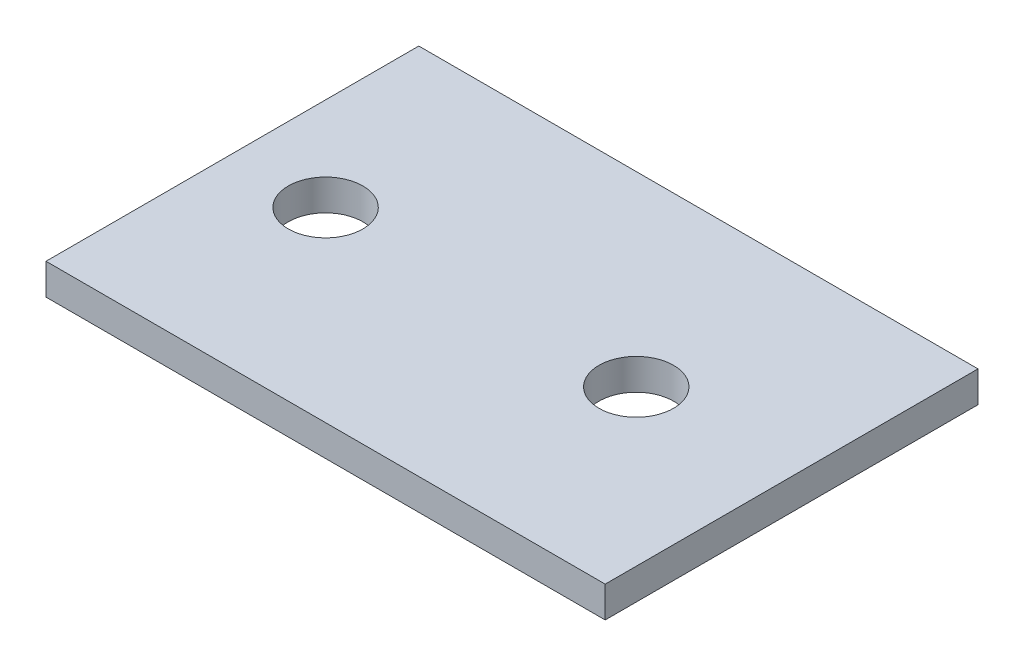
ISO-10303-21;
HEADER;
FILE_DESCRIPTION(('STEP AP214'),'2;1');
FILE_NAME('part.step','',(''),(''),'','','');
FILE_SCHEMA(('AUTOMOTIVE_DESIGN { 1 0 10303 214 1 1 1 1 }'));
ENDSEC;
DATA;
#1=APPLICATION_CONTEXT('core data for automotive mechanical design processes');
#2=APPLICATION_PROTOCOL_DEFINITION('international standard','automotive_design',2000,#1);
#3=PRODUCT_CONTEXT('',#1,'mechanical');
#4=PRODUCT('Part','Part','',(#3));
#5=PRODUCT_RELATED_PRODUCT_CATEGORY('part','',(#4));
#6=PRODUCT_DEFINITION_FORMATION('','',#4);
#7=PRODUCT_DEFINITION_CONTEXT('part definition',#1,'design');
#8=PRODUCT_DEFINITION('design','',#6,#7);
#9=PRODUCT_DEFINITION_SHAPE('','',#8);
#10=(LENGTH_UNIT() NAMED_UNIT(*) SI_UNIT(.MILLI.,.METRE.));
#11=(NAMED_UNIT(*) PLANE_ANGLE_UNIT() SI_UNIT($,.RADIAN.));
#12=(NAMED_UNIT(*) SI_UNIT($,.STERADIAN.) SOLID_ANGLE_UNIT());
#13=UNCERTAINTY_MEASURE_WITH_UNIT(LENGTH_MEASURE(1.E-05),#10,'distance_accuracy_value','');
#14=(GEOMETRIC_REPRESENTATION_CONTEXT(3) GLOBAL_UNCERTAINTY_ASSIGNED_CONTEXT((#13)) GLOBAL_UNIT_ASSIGNED_CONTEXT((#10,
#11,#12)) REPRESENTATION_CONTEXT('',''));
#15=CARTESIAN_POINT('',(0.,0.,0.));
#16=DIRECTION('',(0.,0.,1.));
#17=DIRECTION('',(1.,0.,0.));
#18=AXIS2_PLACEMENT_3D('',#15,#16,#17);
#19=CARTESIAN_POINT('',(0.,2.5,0.));
#20=DIRECTION('',(0.,-1.,0.));
#21=DIRECTION('',(0.,0.,-1.));
#22=AXIS2_PLACEMENT_3D('',#19,#20,#21);
#23=PLANE('',#22);
#24=DIRECTION('',(0.,0.,-1.));
#25=VECTOR('',#24,1.);
#26=CARTESIAN_POINT('',(45.,2.5,30.));
#27=LINE('',#26,#25);
#28=CARTESIAN_POINT('',(45.,2.5,30.));
#29=VERTEX_POINT('',#28);
#30=CARTESIAN_POINT('',(45.,2.5,-30.));
#31=VERTEX_POINT('',#30);
#32=EDGE_CURVE('E85',#29,#31,#27,.T.);
#33=ORIENTED_EDGE('',*,*,#32,.T.);
#34=DIRECTION('',(-1.,0.,0.));
#35=VECTOR('',#34,1.);
#36=CARTESIAN_POINT('',(-45.,2.5,-30.));
#37=LINE('',#36,#35);
#38=CARTESIAN_POINT('',(-45.,2.5,-30.));
#39=VERTEX_POINT('',#38);
#40=EDGE_CURVE('E80',#31,#39,#37,.T.);
#41=ORIENTED_EDGE('',*,*,#40,.T.);
#42=DIRECTION('',(0.,0.,1.));
#43=VECTOR('',#42,1.);
#44=CARTESIAN_POINT('',(-45.,2.5,30.));
#45=LINE('',#44,#43);
#46=CARTESIAN_POINT('',(-45.,2.5,30.));
#47=VERTEX_POINT('',#46);
#48=EDGE_CURVE('E83',#39,#47,#45,.T.);
#49=ORIENTED_EDGE('',*,*,#48,.T.);
#50=DIRECTION('',(1.,0.,0.));
#51=VECTOR('',#50,1.);
#52=CARTESIAN_POINT('',(-45.,2.5,30.));
#53=LINE('',#52,#51);
#54=EDGE_CURVE('E50',#47,#29,#53,.T.);
#55=ORIENTED_EDGE('',*,*,#54,.T.);
#56=EDGE_LOOP('',(#33,#41,#49,#55));
#57=FACE_BOUND('',#56,.T.);
#58=CARTESIAN_POINT('',(-30.,2.5,0.));
#59=DIRECTION('',(0.,1.,0.));
#60=DIRECTION('',(0.,0.,1.));
#61=AXIS2_PLACEMENT_3D('',#58,#59,#60);
#62=CIRCLE('',#61,6.);
#63=CARTESIAN_POINT('',(-30.,2.5,6.));
#64=VERTEX_POINT('',#63);
#65=EDGE_CURVE('E100',#64,#64,#62,.T.);
#66=ORIENTED_EDGE('',*,*,#65,.F.);
#67=EDGE_LOOP('',(#66));
#68=FACE_BOUND('',#67,.T.);
#69=CARTESIAN_POINT('',(20.,2.5,0.));
#70=DIRECTION('',(0.,1.,0.));
#71=DIRECTION('',(0.,0.,1.));
#72=AXIS2_PLACEMENT_3D('',#69,#70,#71);
#73=CIRCLE('',#72,6.);
#74=CARTESIAN_POINT('',(20.,2.5,6.));
#75=VERTEX_POINT('',#74);
#76=EDGE_CURVE('E115',#75,#75,#73,.T.);
#77=ORIENTED_EDGE('',*,*,#76,.F.);
#78=EDGE_LOOP('',(#77));
#79=FACE_BOUND('',#78,.T.);
#80=ADVANCED_FACE('F33',(#57,#68,#79),#23,.F.);
#81=CARTESIAN_POINT('',(0.,-2.5,0.));
#82=DIRECTION('',(0.,-1.,0.));
#83=DIRECTION('',(0.,0.,-1.));
#84=AXIS2_PLACEMENT_3D('',#81,#82,#83);
#85=PLANE('',#84);
#86=CARTESIAN_POINT('',(-30.,-2.5,0.));
#87=DIRECTION('',(0.,1.,0.));
#88=DIRECTION('',(0.,0.,1.));
#89=AXIS2_PLACEMENT_3D('',#86,#87,#88);
#90=CIRCLE('',#89,6.);
#91=CARTESIAN_POINT('',(-30.,-2.5,6.));
#92=VERTEX_POINT('',#91);
#93=EDGE_CURVE('E112',#92,#92,#90,.T.);
#94=ORIENTED_EDGE('',*,*,#93,.T.);
#95=EDGE_LOOP('',(#94));
#96=FACE_BOUND('',#95,.T.);
#97=DIRECTION('',(0.,0.,-1.));
#98=VECTOR('',#97,1.);
#99=CARTESIAN_POINT('',(45.,-2.5,30.));
#100=LINE('',#99,#98);
#101=CARTESIAN_POINT('',(45.,-2.5,30.));
#102=VERTEX_POINT('',#101);
#103=CARTESIAN_POINT('',(45.,-2.5,-30.));
#104=VERTEX_POINT('',#103);
#105=EDGE_CURVE('E97',#102,#104,#100,.T.);
#106=ORIENTED_EDGE('',*,*,#105,.F.);
#107=DIRECTION('',(1.,0.,0.));
#108=VECTOR('',#107,1.);
#109=CARTESIAN_POINT('',(-45.,-2.5,30.));
#110=LINE('',#109,#108);
#111=CARTESIAN_POINT('',(-45.,-2.5,30.));
#112=VERTEX_POINT('',#111);
#113=EDGE_CURVE('E73',#112,#102,#110,.T.);
#114=ORIENTED_EDGE('',*,*,#113,.F.);
#115=DIRECTION('',(0.,0.,1.));
#116=VECTOR('',#115,1.);
#117=CARTESIAN_POINT('',(-45.,-2.5,30.));
#118=LINE('',#117,#116);
#119=CARTESIAN_POINT('',(-45.,-2.5,-30.));
#120=VERTEX_POINT('',#119);
#121=EDGE_CURVE('E67',#120,#112,#118,.T.);
#122=ORIENTED_EDGE('',*,*,#121,.F.);
#123=DIRECTION('',(-1.,0.,0.));
#124=VECTOR('',#123,1.);
#125=CARTESIAN_POINT('',(-45.,-2.5,-30.));
#126=LINE('',#125,#124);
#127=EDGE_CURVE('E89',#104,#120,#126,.T.);
#128=ORIENTED_EDGE('',*,*,#127,.F.);
#129=EDGE_LOOP('',(#106,#114,#122,#128));
#130=FACE_BOUND('',#129,.T.);
#131=CARTESIAN_POINT('',(20.,-2.5,0.));
#132=DIRECTION('',(0.,1.,0.));
#133=DIRECTION('',(0.,0.,1.));
#134=AXIS2_PLACEMENT_3D('',#131,#132,#133);
#135=CIRCLE('',#134,6.);
#136=CARTESIAN_POINT('',(20.,-2.5,6.));
#137=VERTEX_POINT('',#136);
#138=EDGE_CURVE('E118',#137,#137,#135,.T.);
#139=ORIENTED_EDGE('',*,*,#138,.T.);
#140=EDGE_LOOP('',(#139));
#141=FACE_BOUND('',#140,.T.);
#142=ADVANCED_FACE('F108',(#96,#130,#141),#85,.T.);
#143=CARTESIAN_POINT('',(45.,2.5,30.));
#144=DIRECTION('',(-1.,0.,0.));
#145=DIRECTION('',(0.,0.,1.));
#146=AXIS2_PLACEMENT_3D('',#143,#144,#145);
#147=PLANE('',#146);
#148=ORIENTED_EDGE('',*,*,#105,.T.);
#149=DIRECTION('',(0.,-1.,0.));
#150=VECTOR('',#149,1.);
#151=CARTESIAN_POINT('',(45.,2.5,-30.));
#152=LINE('',#151,#150);
#153=EDGE_CURVE('E11',#31,#104,#152,.T.);
#154=ORIENTED_EDGE('',*,*,#153,.F.);
#155=ORIENTED_EDGE('',*,*,#32,.F.);
#156=DIRECTION('',(0.,-1.,0.));
#157=VECTOR('',#156,1.);
#158=CARTESIAN_POINT('',(45.,2.5,30.));
#159=LINE('',#158,#157);
#160=EDGE_CURVE('E93',#29,#102,#159,.T.);
#161=ORIENTED_EDGE('',*,*,#160,.T.);
#162=EDGE_LOOP('',(#148,#154,#155,#161));
#163=FACE_BOUND('',#162,.T.);
#164=ADVANCED_FACE('F35',(#163),#147,.F.);
#165=CARTESIAN_POINT('',(-45.,2.5,-30.));
#166=DIRECTION('',(0.,0.,1.));
#167=DIRECTION('',(1.,0.,0.));
#168=AXIS2_PLACEMENT_3D('',#165,#166,#167);
#169=PLANE('',#168);
#170=ORIENTED_EDGE('',*,*,#127,.T.);
#171=DIRECTION('',(0.,-1.,0.));
#172=VECTOR('',#171,1.);
#173=CARTESIAN_POINT('',(-45.,2.5,-30.));
#174=LINE('',#173,#172);
#175=EDGE_CURVE('E42',#39,#120,#174,.T.);
#176=ORIENTED_EDGE('',*,*,#175,.F.);
#177=ORIENTED_EDGE('',*,*,#40,.F.);
#178=ORIENTED_EDGE('',*,*,#153,.T.);
#179=EDGE_LOOP('',(#170,#176,#177,#178));
#180=FACE_BOUND('',#179,.T.);
#181=ADVANCED_FACE('F88',(#180),#169,.F.);
#182=CARTESIAN_POINT('',(-45.,2.5,30.));
#183=DIRECTION('',(1.,0.,0.));
#184=DIRECTION('',(0.,0.,-1.));
#185=AXIS2_PLACEMENT_3D('',#182,#183,#184);
#186=PLANE('',#185);
#187=ORIENTED_EDGE('',*,*,#121,.T.);
#188=DIRECTION('',(0.,-1.,0.));
#189=VECTOR('',#188,1.);
#190=CARTESIAN_POINT('',(-45.,2.5,30.));
#191=LINE('',#190,#189);
#192=EDGE_CURVE('E90',#47,#112,#191,.T.);
#193=ORIENTED_EDGE('',*,*,#192,.F.);
#194=ORIENTED_EDGE('',*,*,#48,.F.);
#195=ORIENTED_EDGE('',*,*,#175,.T.);
#196=EDGE_LOOP('',(#187,#193,#194,#195));
#197=FACE_BOUND('',#196,.T.);
#198=ADVANCED_FACE('F91',(#197),#186,.F.);
#199=CARTESIAN_POINT('',(-45.,2.5,30.));
#200=DIRECTION('',(0.,0.,-1.));
#201=DIRECTION('',(-1.,0.,0.));
#202=AXIS2_PLACEMENT_3D('',#199,#200,#201);
#203=PLANE('',#202);
#204=ORIENTED_EDGE('',*,*,#113,.T.);
#205=ORIENTED_EDGE('',*,*,#160,.F.);
#206=ORIENTED_EDGE('',*,*,#54,.F.);
#207=ORIENTED_EDGE('',*,*,#192,.T.);
#208=EDGE_LOOP('',(#204,#205,#206,#207));
#209=FACE_BOUND('',#208,.T.);
#210=ADVANCED_FACE('F105',(#209),#203,.F.);
#211=CARTESIAN_POINT('',(-30.,2.5,0.));
#212=DIRECTION('',(0.,-1.,0.));
#213=DIRECTION('',(0.,0.,-1.));
#214=AXIS2_PLACEMENT_3D('',#211,#212,#213);
#215=CYLINDRICAL_SURFACE('',#214,6.);
#216=ORIENTED_EDGE('',*,*,#65,.T.);
#217=EDGE_LOOP('',(#216));
#218=FACE_BOUND('',#217,.T.);
#219=ORIENTED_EDGE('',*,*,#93,.F.);
#220=EDGE_LOOP('',(#219));
#221=FACE_BOUND('',#220,.T.);
#222=ADVANCED_FACE('F135',(#218,#221),#215,.F.);
#223=CARTESIAN_POINT('',(20.,2.5,0.));
#224=DIRECTION('',(0.,-1.,0.));
#225=DIRECTION('',(0.,0.,-1.));
#226=AXIS2_PLACEMENT_3D('',#223,#224,#225);
#227=CYLINDRICAL_SURFACE('',#226,6.);
#228=ORIENTED_EDGE('',*,*,#76,.T.);
#229=EDGE_LOOP('',(#228));
#230=FACE_BOUND('',#229,.T.);
#231=ORIENTED_EDGE('',*,*,#138,.F.);
#232=EDGE_LOOP('',(#231));
#233=FACE_BOUND('',#232,.T.);
#234=ADVANCED_FACE('F124',(#230,#233),#227,.F.);
#235=CLOSED_SHELL('',(#80,#142,#164,#181,#198,#210,#222,#234));
#236=MANIFOLD_SOLID_BREP('B2',#235);
#237=ADVANCED_BREP_SHAPE_REPRESENTATION('',(#18,#236),#14);
#238=SHAPE_DEFINITION_REPRESENTATION(#9,#237);
ENDSEC;
END-ISO-10303-21;
